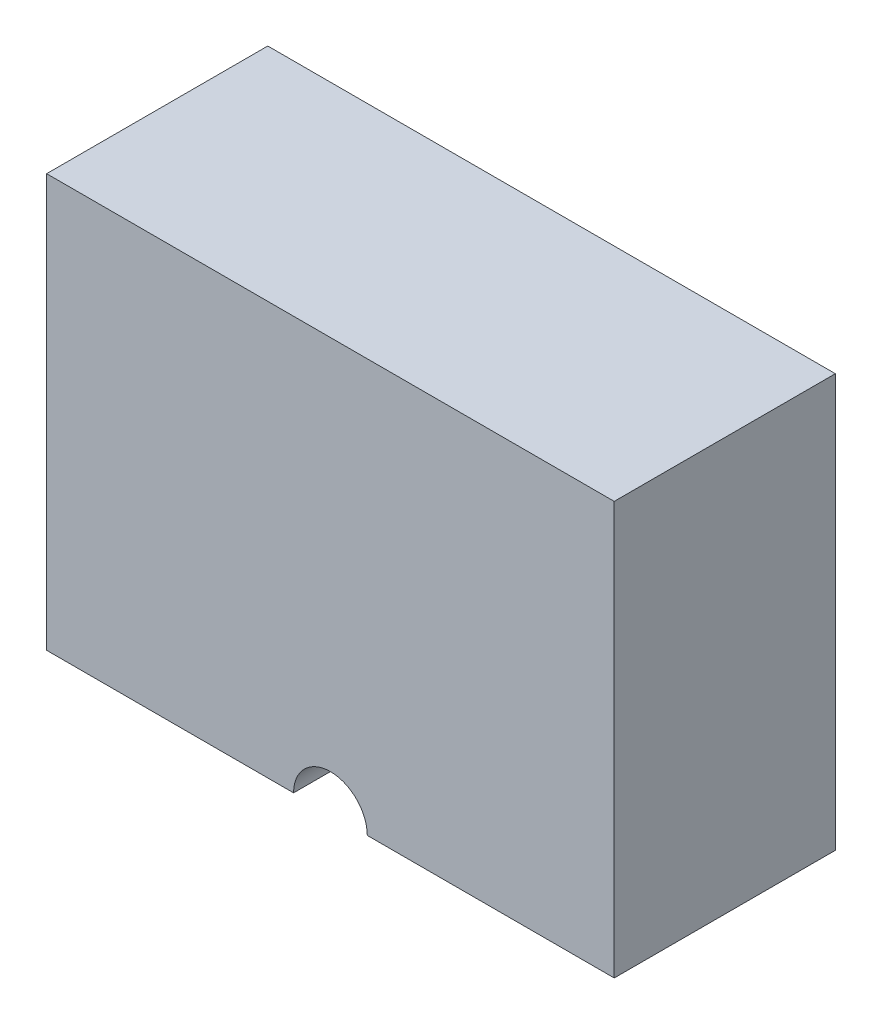
ISO-10303-21;
HEADER;
FILE_DESCRIPTION(('STEP AP214'),'2;1');
FILE_NAME('part.step','',(''),(''),'','','');
FILE_SCHEMA(('AUTOMOTIVE_DESIGN { 1 0 10303 214 1 1 1 1 }'));
ENDSEC;
DATA;
#1=APPLICATION_CONTEXT('core data for automotive mechanical design processes');
#2=APPLICATION_PROTOCOL_DEFINITION('international standard','automotive_design',2000,#1);
#3=PRODUCT_CONTEXT('',#1,'mechanical');
#4=PRODUCT('Part','Part','',(#3));
#5=PRODUCT_RELATED_PRODUCT_CATEGORY('part','',(#4));
#6=PRODUCT_DEFINITION_FORMATION('','',#4);
#7=PRODUCT_DEFINITION_CONTEXT('part definition',#1,'design');
#8=PRODUCT_DEFINITION('design','',#6,#7);
#9=PRODUCT_DEFINITION_SHAPE('','',#8);
#10=(LENGTH_UNIT() NAMED_UNIT(*) SI_UNIT(.MILLI.,.METRE.));
#11=(NAMED_UNIT(*) PLANE_ANGLE_UNIT() SI_UNIT($,.RADIAN.));
#12=(NAMED_UNIT(*) SI_UNIT($,.STERADIAN.) SOLID_ANGLE_UNIT());
#13=UNCERTAINTY_MEASURE_WITH_UNIT(LENGTH_MEASURE(1.E-05),#10,'distance_accuracy_value','');
#14=(GEOMETRIC_REPRESENTATION_CONTEXT(3) GLOBAL_UNCERTAINTY_ASSIGNED_CONTEXT((#13)) GLOBAL_UNIT_ASSIGNED_CONTEXT((#10,
#11,#12)) REPRESENTATION_CONTEXT('',''));
#15=CARTESIAN_POINT('',(0.,0.,0.));
#16=DIRECTION('',(0.,0.,1.));
#17=DIRECTION('',(1.,0.,0.));
#18=AXIS2_PLACEMENT_3D('',#15,#16,#17);
#19=CARTESIAN_POINT('',(-3.35,2.2,0.5));
#20=DIRECTION('',(0.,0.,-1.));
#21=DIRECTION('',(-1.,0.,0.));
#22=AXIS2_PLACEMENT_3D('',#19,#20,#21);
#23=PLANE('',#22);
#24=DIRECTION('',(0.,1.,0.));
#25=VECTOR('',#24,1.);
#26=CARTESIAN_POINT('',(2.35,-2.8,0.5));
#27=LINE('',#26,#25);
#28=CARTESIAN_POINT('',(2.35,-2.8,0.5));
#29=VERTEX_POINT('',#28);
#30=CARTESIAN_POINT('',(2.35,2.2,0.5));
#31=VERTEX_POINT('',#30);
#32=EDGE_CURVE('E59',#29,#31,#27,.T.);
#33=ORIENTED_EDGE('',*,*,#32,.T.);
#34=DIRECTION('',(1.,0.,0.));
#35=VECTOR('',#34,1.);
#36=CARTESIAN_POINT('',(-3.35,2.2,0.5));
#37=LINE('',#36,#35);
#38=CARTESIAN_POINT('',(-2.35,2.2,0.5));
#39=VERTEX_POINT('',#38);
#40=EDGE_CURVE('E141',#39,#31,#37,.T.);
#41=ORIENTED_EDGE('',*,*,#40,.F.);
#42=DIRECTION('',(0.,1.,0.));
#43=VECTOR('',#42,1.);
#44=CARTESIAN_POINT('',(-2.35,-2.8,0.5));
#45=LINE('',#44,#43);
#46=CARTESIAN_POINT('',(-2.35,-2.8,0.5));
#47=VERTEX_POINT('',#46);
#48=EDGE_CURVE('E170',#47,#39,#45,.T.);
#49=ORIENTED_EDGE('',*,*,#48,.F.);
#50=DIRECTION('',(1.,0.,0.));
#51=VECTOR('',#50,1.);
#52=CARTESIAN_POINT('',(-3.35,-2.8,0.5));
#53=LINE('',#52,#51);
#54=CARTESIAN_POINT('',(-0.5,-2.8,0.5));
#55=VERTEX_POINT('',#54);
#56=EDGE_CURVE('E179',#47,#55,#53,.T.);
#57=ORIENTED_EDGE('',*,*,#56,.T.);
#58=CARTESIAN_POINT('',(0.,-2.8,0.5));
#59=DIRECTION('',(0.,0.,-1.));
#60=DIRECTION('',(-1.,0.,0.));
#61=AXIS2_PLACEMENT_3D('',#58,#59,#60);
#62=CIRCLE('',#61,0.5);
#63=CARTESIAN_POINT('',(0.5,-2.8,0.5));
#64=VERTEX_POINT('',#63);
#65=EDGE_CURVE('E52',#64,#55,#62,.F.);
#66=ORIENTED_EDGE('',*,*,#65,.F.);
#67=EDGE_CURVE('E64',#64,#29,#53,.T.);
#68=ORIENTED_EDGE('',*,*,#67,.T.);
#69=EDGE_LOOP('',(#33,#41,#49,#57,#66,#68));
#70=FACE_BOUND('',#69,.T.);
#71=ADVANCED_FACE('F43',(#70),#23,.F.);
#72=CARTESIAN_POINT('',(0.,2.2,0.));
#73=DIRECTION('',(0.,-1.,0.));
#74=DIRECTION('',(0.,0.,-1.));
#75=AXIS2_PLACEMENT_3D('',#72,#73,#74);
#76=PLANE('',#75);
#77=ORIENTED_EDGE('',*,*,#40,.T.);
#78=DIRECTION('',(-0.447213595499958,0.,-0.894427190999916));
#79=VECTOR('',#78,1.);
#80=CARTESIAN_POINT('',(2.35,2.2,0.5));
#81=LINE('',#80,#79);
#82=CARTESIAN_POINT('',(3.35,2.2,2.5));
#83=VERTEX_POINT('',#82);
#84=EDGE_CURVE('E159',#83,#31,#81,.T.);
#85=ORIENTED_EDGE('',*,*,#84,.F.);
#86=DIRECTION('',(-1.,0.,0.));
#87=VECTOR('',#86,1.);
#88=CARTESIAN_POINT('',(-3.35,2.2,2.5));
#89=LINE('',#88,#87);
#90=CARTESIAN_POINT('',(-3.35,2.2,2.5));
#91=VERTEX_POINT('',#90);
#92=EDGE_CURVE('E151',#83,#91,#89,.T.);
#93=ORIENTED_EDGE('',*,*,#92,.T.);
#94=DIRECTION('',(-0.447213595499958,0.,0.894427190999916));
#95=VECTOR('',#94,1.);
#96=CARTESIAN_POINT('',(-3.35,2.2,2.5));
#97=LINE('',#96,#95);
#98=EDGE_CURVE('E163',#39,#91,#97,.T.);
#99=ORIENTED_EDGE('',*,*,#98,.F.);
#100=EDGE_LOOP('',(#77,#85,#93,#99));
#101=FACE_BOUND('',#100,.T.);
#102=ADVANCED_FACE('F295',(#101),#76,.T.);
#103=CARTESIAN_POINT('',(0.,-2.8,-5.8));
#104=DIRECTION('',(0.,0.,1.));
#105=DIRECTION('',(1.,0.,0.));
#106=AXIS2_PLACEMENT_3D('',#103,#104,#105);
#107=CYLINDRICAL_SURFACE('',#106,0.5);
#108=DIRECTION('',(0.,0.,1.));
#109=VECTOR('',#108,1.);
#110=CARTESIAN_POINT('',(-0.5,-2.8,-5.8));
#111=LINE('',#110,#109);
#112=CARTESIAN_POINT('',(-0.5,-2.8,2.5));
#113=VERTEX_POINT('',#112);
#114=CARTESIAN_POINT('',(-0.5,-2.8,3.));
#115=VERTEX_POINT('',#114);
#116=EDGE_CURVE('E192',#113,#115,#111,.T.);
#117=ORIENTED_EDGE('',*,*,#116,.F.);
#118=CARTESIAN_POINT('',(0.,-2.8,2.5));
#119=DIRECTION('',(0.,0.,1.));
#120=DIRECTION('',(1.,0.,0.));
#121=AXIS2_PLACEMENT_3D('',#118,#119,#120);
#122=CIRCLE('',#121,0.5);
#123=CARTESIAN_POINT('',(0.5,-2.8,2.5));
#124=VERTEX_POINT('',#123);
#125=EDGE_CURVE('E11',#113,#124,#122,.F.);
#126=ORIENTED_EDGE('',*,*,#125,.T.);
#127=DIRECTION('',(0.,0.,1.));
#128=VECTOR('',#127,1.);
#129=CARTESIAN_POINT('',(0.5,-2.8,-5.8));
#130=LINE('',#129,#128);
#131=CARTESIAN_POINT('',(0.5,-2.8,3.));
#132=VERTEX_POINT('',#131);
#133=EDGE_CURVE('E138',#132,#124,#130,.F.);
#134=ORIENTED_EDGE('',*,*,#133,.F.);
#135=CARTESIAN_POINT('',(0.,-2.8,3.));
#136=DIRECTION('',(0.,0.,1.));
#137=DIRECTION('',(1.,0.,0.));
#138=AXIS2_PLACEMENT_3D('',#135,#136,#137);
#139=CIRCLE('',#138,0.5);
#140=EDGE_CURVE('E184',#132,#115,#139,.T.);
#141=ORIENTED_EDGE('',*,*,#140,.T.);
#142=EDGE_LOOP('',(#117,#126,#134,#141));
#143=FACE_BOUND('',#142,.T.);
#144=ADVANCED_FACE('F271',(#143),#107,.F.);
#145=CARTESIAN_POINT('',(-3.85,-2.8,3.));
#146=DIRECTION('',(0.,1.,0.));
#147=DIRECTION('',(0.,0.,1.));
#148=AXIS2_PLACEMENT_3D('',#145,#146,#147);
#149=PLANE('',#148);
#150=ORIENTED_EDGE('',*,*,#56,.F.);
#151=DIRECTION('',(-0.447213595499958,0.,0.894427190999916));
#152=VECTOR('',#151,1.);
#153=CARTESIAN_POINT('',(-3.35,-2.8,2.5));
#154=LINE('',#153,#152);
#155=CARTESIAN_POINT('',(-3.35,-2.8,2.5));
#156=VERTEX_POINT('',#155);
#157=EDGE_CURVE('E167',#47,#156,#154,.T.);
#158=ORIENTED_EDGE('',*,*,#157,.T.);
#159=DIRECTION('',(-1.,0.,0.));
#160=VECTOR('',#159,1.);
#161=CARTESIAN_POINT('',(-3.35,-2.8,2.5));
#162=LINE('',#161,#160);
#163=EDGE_CURVE('E142',#113,#156,#162,.T.);
#164=ORIENTED_EDGE('',*,*,#163,.F.);
#165=ORIENTED_EDGE('',*,*,#116,.T.);
#166=DIRECTION('',(1.,0.,0.));
#167=VECTOR('',#166,1.);
#168=CARTESIAN_POINT('',(-3.85,-2.8,3.));
#169=LINE('',#168,#167);
#170=CARTESIAN_POINT('',(-3.85,-2.8,3.));
#171=VERTEX_POINT('',#170);
#172=EDGE_CURVE('E204',#171,#115,#169,.T.);
#173=ORIENTED_EDGE('',*,*,#172,.F.);
#174=DIRECTION('',(0.,0.,-1.));
#175=VECTOR('',#174,1.);
#176=CARTESIAN_POINT('',(-3.85,-2.8,3.));
#177=LINE('',#176,#175);
#178=CARTESIAN_POINT('',(-3.85,-2.8,0.));
#179=VERTEX_POINT('',#178);
#180=EDGE_CURVE('E239',#171,#179,#177,.T.);
#181=ORIENTED_EDGE('',*,*,#180,.T.);
#182=DIRECTION('',(1.,0.,0.));
#183=VECTOR('',#182,1.);
#184=CARTESIAN_POINT('',(-3.85,-2.8,0.));
#185=LINE('',#184,#183);
#186=CARTESIAN_POINT('',(-0.5,-2.8,0.));
#187=VERTEX_POINT('',#186);
#188=EDGE_CURVE('E219',#179,#187,#185,.T.);
#189=ORIENTED_EDGE('',*,*,#188,.T.);
#190=EDGE_CURVE('E193',#187,#55,#111,.T.);
#191=ORIENTED_EDGE('',*,*,#190,.T.);
#192=EDGE_LOOP('',(#150,#158,#164,#165,#173,#181,#189,#191));
#193=FACE_BOUND('',#192,.T.);
#194=ADVANCED_FACE('F254',(#193),#149,.F.);
#195=CARTESIAN_POINT('',(-3.85,2.8,3.));
#196=DIRECTION('',(1.,0.,0.));
#197=DIRECTION('',(0.,1.,0.));
#198=AXIS2_PLACEMENT_3D('',#195,#196,#197);
#199=PLANE('',#198);
#200=DIRECTION('',(0.,-1.,0.));
#201=VECTOR('',#200,1.);
#202=CARTESIAN_POINT('',(-3.85,2.8,0.));
#203=LINE('',#202,#201);
#204=CARTESIAN_POINT('',(-3.85,2.8,0.));
#205=VERTEX_POINT('',#204);
#206=EDGE_CURVE('E197',#205,#179,#203,.T.);
#207=ORIENTED_EDGE('',*,*,#206,.T.);
#208=ORIENTED_EDGE('',*,*,#180,.F.);
#209=DIRECTION('',(0.,-1.,0.));
#210=VECTOR('',#209,1.);
#211=CARTESIAN_POINT('',(-3.85,2.8,3.));
#212=LINE('',#211,#210);
#213=CARTESIAN_POINT('',(-3.85,2.8,3.));
#214=VERTEX_POINT('',#213);
#215=EDGE_CURVE('E198',#214,#171,#212,.T.);
#216=ORIENTED_EDGE('',*,*,#215,.F.);
#217=DIRECTION('',(0.,0.,-1.));
#218=VECTOR('',#217,1.);
#219=CARTESIAN_POINT('',(-3.85,2.8,3.));
#220=LINE('',#219,#218);
#221=EDGE_CURVE('E214',#214,#205,#220,.T.);
#222=ORIENTED_EDGE('',*,*,#221,.T.);
#223=EDGE_LOOP('',(#207,#208,#216,#222));
#224=FACE_BOUND('',#223,.T.);
#225=ADVANCED_FACE('F45',(#224),#199,.F.);
#226=ORIENTED_EDGE('',*,*,#133,.T.);
#227=CARTESIAN_POINT('',(3.35,-2.8,2.5));
#228=VERTEX_POINT('',#227);
#229=EDGE_CURVE('E132',#228,#124,#162,.T.);
#230=ORIENTED_EDGE('',*,*,#229,.F.);
#231=DIRECTION('',(-0.447213595499958,0.,-0.894427190999916));
#232=VECTOR('',#231,1.);
#233=CARTESIAN_POINT('',(2.35,-2.8,0.5));
#234=LINE('',#233,#232);
#235=EDGE_CURVE('E136',#228,#29,#234,.T.);
#236=ORIENTED_EDGE('',*,*,#235,.T.);
#237=ORIENTED_EDGE('',*,*,#67,.F.);
#238=CARTESIAN_POINT('',(0.5,-2.8,0.));
#239=VERTEX_POINT('',#238);
#240=EDGE_CURVE('E189',#64,#239,#130,.F.);
#241=ORIENTED_EDGE('',*,*,#240,.T.);
#242=CARTESIAN_POINT('',(3.85,-2.8,0.));
#243=VERTEX_POINT('',#242);
#244=EDGE_CURVE('E218',#239,#243,#185,.T.);
#245=ORIENTED_EDGE('',*,*,#244,.T.);
#246=DIRECTION('',(0.,0.,-1.));
#247=VECTOR('',#246,1.);
#248=CARTESIAN_POINT('',(3.85,-2.8,3.));
#249=LINE('',#248,#247);
#250=CARTESIAN_POINT('',(3.85,-2.8,3.));
#251=VERTEX_POINT('',#250);
#252=EDGE_CURVE('E235',#251,#243,#249,.T.);
#253=ORIENTED_EDGE('',*,*,#252,.F.);
#254=EDGE_CURVE('E202',#132,#251,#169,.T.);
#255=ORIENTED_EDGE('',*,*,#254,.F.);
#256=EDGE_LOOP('',(#226,#230,#236,#237,#241,#245,#253,#255));
#257=FACE_BOUND('',#256,.T.);
#258=ADVANCED_FACE('F134',(#257),#149,.F.);
#259=CARTESIAN_POINT('',(3.85,2.8,3.));
#260=DIRECTION('',(-1.,0.,0.));
#261=DIRECTION('',(0.,0.,1.));
#262=AXIS2_PLACEMENT_3D('',#259,#260,#261);
#263=PLANE('',#262);
#264=DIRECTION('',(0.,1.,0.));
#265=VECTOR('',#264,1.);
#266=CARTESIAN_POINT('',(3.85,2.8,0.));
#267=LINE('',#266,#265);
#268=CARTESIAN_POINT('',(3.85,2.8,0.));
#269=VERTEX_POINT('',#268);
#270=EDGE_CURVE('E223',#243,#269,#267,.T.);
#271=ORIENTED_EDGE('',*,*,#270,.T.);
#272=DIRECTION('',(0.,0.,-1.));
#273=VECTOR('',#272,1.);
#274=CARTESIAN_POINT('',(3.85,2.8,3.));
#275=LINE('',#274,#273);
#276=CARTESIAN_POINT('',(3.85,2.8,3.));
#277=VERTEX_POINT('',#276);
#278=EDGE_CURVE('E231',#277,#269,#275,.T.);
#279=ORIENTED_EDGE('',*,*,#278,.F.);
#280=DIRECTION('',(0.,1.,0.));
#281=VECTOR('',#280,1.);
#282=CARTESIAN_POINT('',(3.85,2.8,3.));
#283=LINE('',#282,#281);
#284=EDGE_CURVE('E208',#251,#277,#283,.T.);
#285=ORIENTED_EDGE('',*,*,#284,.F.);
#286=ORIENTED_EDGE('',*,*,#252,.T.);
#287=EDGE_LOOP('',(#271,#279,#285,#286));
#288=FACE_BOUND('',#287,.T.);
#289=ADVANCED_FACE('F284',(#288),#263,.F.);
#290=CARTESIAN_POINT('',(-3.85,2.8,3.));
#291=DIRECTION('',(0.,-1.,0.));
#292=DIRECTION('',(0.,0.,-1.));
#293=AXIS2_PLACEMENT_3D('',#290,#291,#292);
#294=PLANE('',#293);
#295=DIRECTION('',(-1.,0.,0.));
#296=VECTOR('',#295,1.);
#297=CARTESIAN_POINT('',(-3.85,2.8,0.));
#298=LINE('',#297,#296);
#299=EDGE_CURVE('E203',#269,#205,#298,.T.);
#300=ORIENTED_EDGE('',*,*,#299,.T.);
#301=ORIENTED_EDGE('',*,*,#221,.F.);
#302=DIRECTION('',(-1.,0.,0.));
#303=VECTOR('',#302,1.);
#304=CARTESIAN_POINT('',(-3.85,2.8,3.));
#305=LINE('',#304,#303);
#306=EDGE_CURVE('E211',#277,#214,#305,.T.);
#307=ORIENTED_EDGE('',*,*,#306,.F.);
#308=ORIENTED_EDGE('',*,*,#278,.T.);
#309=EDGE_LOOP('',(#300,#301,#307,#308));
#310=FACE_BOUND('',#309,.T.);
#311=ADVANCED_FACE('F280',(#310),#294,.F.);
#312=CARTESIAN_POINT('',(0.,0.,3.));
#313=DIRECTION('',(0.,0.,1.));
#314=DIRECTION('',(1.,0.,0.));
#315=AXIS2_PLACEMENT_3D('',#312,#313,#314);
#316=PLANE('',#315);
#317=ORIENTED_EDGE('',*,*,#140,.F.);
#318=ORIENTED_EDGE('',*,*,#254,.T.);
#319=ORIENTED_EDGE('',*,*,#284,.T.);
#320=ORIENTED_EDGE('',*,*,#306,.T.);
#321=ORIENTED_EDGE('',*,*,#215,.T.);
#322=ORIENTED_EDGE('',*,*,#172,.T.);
#323=EDGE_LOOP('',(#317,#318,#319,#320,#321,#322));
#324=FACE_BOUND('',#323,.T.);
#325=ADVANCED_FACE('F274',(#324),#316,.T.);
#326=CARTESIAN_POINT('',(0.,0.,0.));
#327=DIRECTION('',(0.,0.,1.));
#328=DIRECTION('',(1.,0.,0.));
#329=AXIS2_PLACEMENT_3D('',#326,#327,#328);
#330=PLANE('',#329);
#331=ORIENTED_EDGE('',*,*,#244,.F.);
#332=CARTESIAN_POINT('',(0.,-2.8,0.));
#333=DIRECTION('',(0.,0.,1.));
#334=DIRECTION('',(1.,0.,0.));
#335=AXIS2_PLACEMENT_3D('',#332,#333,#334);
#336=CIRCLE('',#335,0.5);
#337=EDGE_CURVE('E243',#239,#187,#336,.T.);
#338=ORIENTED_EDGE('',*,*,#337,.T.);
#339=ORIENTED_EDGE('',*,*,#188,.F.);
#340=ORIENTED_EDGE('',*,*,#206,.F.);
#341=ORIENTED_EDGE('',*,*,#299,.F.);
#342=ORIENTED_EDGE('',*,*,#270,.F.);
#343=EDGE_LOOP('',(#331,#338,#339,#340,#341,#342));
#344=FACE_BOUND('',#343,.T.);
#345=ADVANCED_FACE('F259',(#344),#330,.F.);
#346=ORIENTED_EDGE('',*,*,#240,.F.);
#347=ORIENTED_EDGE('',*,*,#65,.T.);
#348=ORIENTED_EDGE('',*,*,#190,.F.);
#349=ORIENTED_EDGE('',*,*,#337,.F.);
#350=EDGE_LOOP('',(#346,#347,#348,#349));
#351=FACE_BOUND('',#350,.T.);
#352=ADVANCED_FACE('F250',(#351),#107,.F.);
#353=CARTESIAN_POINT('',(-3.35,2.2,2.5));
#354=DIRECTION('',(0.,0.,1.));
#355=DIRECTION('',(1.,0.,0.));
#356=AXIS2_PLACEMENT_3D('',#353,#354,#355);
#357=PLANE('',#356);
#358=ORIENTED_EDGE('',*,*,#163,.T.);
#359=DIRECTION('',(0.,-1.,0.));
#360=VECTOR('',#359,1.);
#361=CARTESIAN_POINT('',(-3.35,2.2,2.5));
#362=LINE('',#361,#360);
#363=EDGE_CURVE('E155',#91,#156,#362,.T.);
#364=ORIENTED_EDGE('',*,*,#363,.F.);
#365=ORIENTED_EDGE('',*,*,#92,.F.);
#366=DIRECTION('',(0.,-1.,0.));
#367=VECTOR('',#366,1.);
#368=CARTESIAN_POINT('',(3.35,2.2,2.5));
#369=LINE('',#368,#367);
#370=EDGE_CURVE('E146',#83,#228,#369,.T.);
#371=ORIENTED_EDGE('',*,*,#370,.T.);
#372=ORIENTED_EDGE('',*,*,#229,.T.);
#373=ORIENTED_EDGE('',*,*,#125,.F.);
#374=EDGE_LOOP('',(#358,#364,#365,#371,#372,#373));
#375=FACE_BOUND('',#374,.T.);
#376=ADVANCED_FACE('F148',(#375),#357,.F.);
#377=CARTESIAN_POINT('',(-3.35,-2.8,2.5));
#378=DIRECTION('',(-0.894427190999916,0.,-0.447213595499958));
#379=DIRECTION('',(-0.447213595499958,0.,0.894427190999916));
#380=AXIS2_PLACEMENT_3D('',#377,#378,#379);
#381=PLANE('',#380);
#382=ORIENTED_EDGE('',*,*,#98,.T.);
#383=ORIENTED_EDGE('',*,*,#363,.T.);
#384=ORIENTED_EDGE('',*,*,#157,.F.);
#385=ORIENTED_EDGE('',*,*,#48,.T.);
#386=EDGE_LOOP('',(#382,#383,#384,#385));
#387=FACE_BOUND('',#386,.T.);
#388=ADVANCED_FACE('F335',(#387),#381,.F.);
#389=CARTESIAN_POINT('',(2.35,-2.8,0.5));
#390=DIRECTION('',(0.894427190999916,0.,-0.447213595499958));
#391=DIRECTION('',(-0.447213595499958,0.,-0.894427190999916));
#392=AXIS2_PLACEMENT_3D('',#389,#390,#391);
#393=PLANE('',#392);
#394=ORIENTED_EDGE('',*,*,#84,.T.);
#395=ORIENTED_EDGE('',*,*,#32,.F.);
#396=ORIENTED_EDGE('',*,*,#235,.F.);
#397=ORIENTED_EDGE('',*,*,#370,.F.);
#398=EDGE_LOOP('',(#394,#395,#396,#397));
#399=FACE_BOUND('',#398,.T.);
#400=ADVANCED_FACE('F157',(#399),#393,.F.);
#401=CLOSED_SHELL('',(#71,#102,#144,#194,#225,#258,#289,#311,#325,#345,#352,#376,#388,#400));
#402=MANIFOLD_SOLID_BREP('B2',#401);
#403=ADVANCED_BREP_SHAPE_REPRESENTATION('',(#18,#402),#14);
#404=SHAPE_DEFINITION_REPRESENTATION(#9,#403);
ENDSEC;
END-ISO-10303-21;
